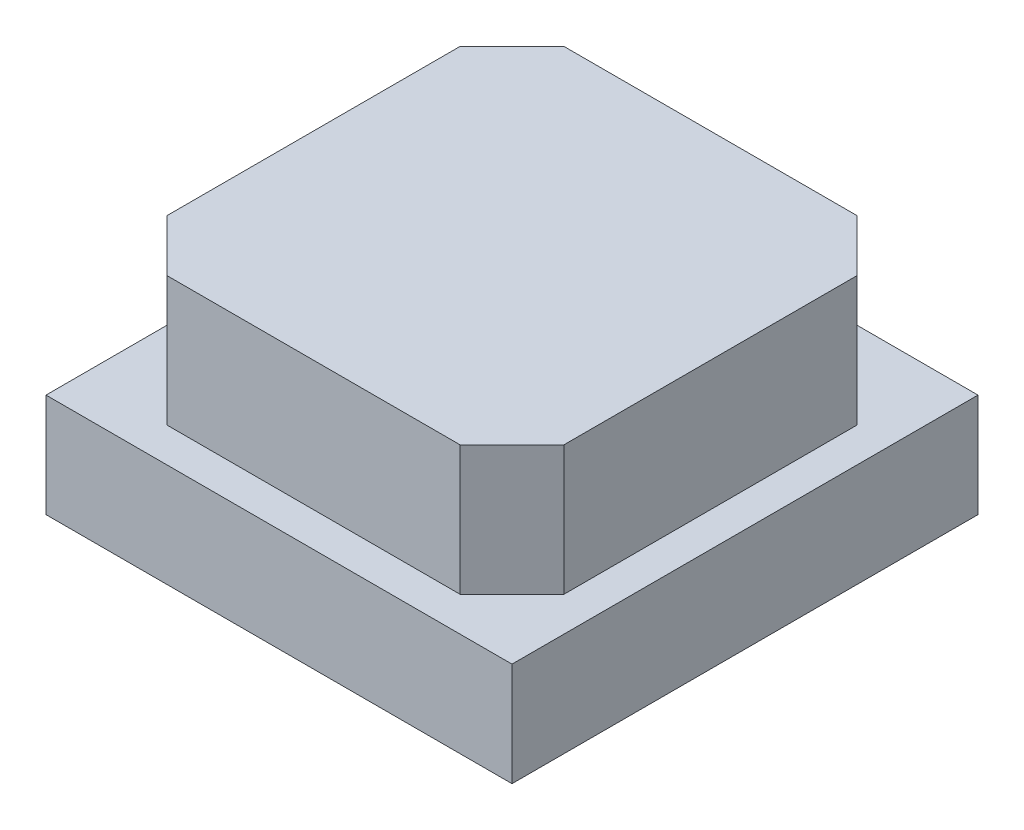
ISO-10303-21;
HEADER;
FILE_DESCRIPTION(('STEP AP214'),'2;1');
FILE_NAME('part.step','',(''),(''),'','','');
FILE_SCHEMA(('AUTOMOTIVE_DESIGN { 1 0 10303 214 1 1 1 1 }'));
ENDSEC;
DATA;
#1=APPLICATION_CONTEXT('core data for automotive mechanical design processes');
#2=APPLICATION_PROTOCOL_DEFINITION('international standard','automotive_design',2000,#1);
#3=PRODUCT_CONTEXT('',#1,'mechanical');
#4=PRODUCT('Part','Part','',(#3));
#5=PRODUCT_RELATED_PRODUCT_CATEGORY('part','',(#4));
#6=PRODUCT_DEFINITION_FORMATION('','',#4);
#7=PRODUCT_DEFINITION_CONTEXT('part definition',#1,'design');
#8=PRODUCT_DEFINITION('design','',#6,#7);
#9=PRODUCT_DEFINITION_SHAPE('','',#8);
#10=(LENGTH_UNIT() NAMED_UNIT(*) SI_UNIT(.MILLI.,.METRE.));
#11=(NAMED_UNIT(*) PLANE_ANGLE_UNIT() SI_UNIT($,.RADIAN.));
#12=(NAMED_UNIT(*) SI_UNIT($,.STERADIAN.) SOLID_ANGLE_UNIT());
#13=UNCERTAINTY_MEASURE_WITH_UNIT(LENGTH_MEASURE(1.E-05),#10,'distance_accuracy_value','');
#14=(GEOMETRIC_REPRESENTATION_CONTEXT(3) GLOBAL_UNCERTAINTY_ASSIGNED_CONTEXT((#13)) GLOBAL_UNIT_ASSIGNED_CONTEXT((#10,
#11,#12)) REPRESENTATION_CONTEXT('',''));
#15=CARTESIAN_POINT('',(0.,0.,0.));
#16=DIRECTION('',(0.,0.,1.));
#17=DIRECTION('',(1.,0.,0.));
#18=AXIS2_PLACEMENT_3D('',#15,#16,#17);
#19=CARTESIAN_POINT('',(0.,2.7,0.));
#20=DIRECTION('',(0.,1.,0.));
#21=DIRECTION('',(0.,0.,1.));
#22=AXIS2_PLACEMENT_3D('',#19,#20,#21);
#23=PLANE('',#22);
#24=DIRECTION('',(0.707106781186547,0.,0.707106781186547));
#25=VECTOR('',#24,1.);
#26=CARTESIAN_POINT('',(-2.3,2.7,1.7));
#27=LINE('',#26,#25);
#28=CARTESIAN_POINT('',(-2.3,2.7,1.7));
#29=VERTEX_POINT('',#28);
#30=CARTESIAN_POINT('',(-1.7,2.7,2.3));
#31=VERTEX_POINT('',#30);
#32=EDGE_CURVE('E20',#29,#31,#27,.T.);
#33=ORIENTED_EDGE('',*,*,#32,.T.);
#34=DIRECTION('',(1.,0.,0.));
#35=VECTOR('',#34,1.);
#36=CARTESIAN_POINT('',(-2.3,2.7,2.3));
#37=LINE('',#36,#35);
#38=CARTESIAN_POINT('',(1.7,2.7,2.3));
#39=VERTEX_POINT('',#38);
#40=EDGE_CURVE('E146',#39,#31,#37,.F.);
#41=ORIENTED_EDGE('',*,*,#40,.F.);
#42=DIRECTION('',(0.707106781186548,0.,-0.707106781186548));
#43=VECTOR('',#42,1.);
#44=CARTESIAN_POINT('',(2.,2.7,2.));
#45=LINE('',#44,#43);
#46=CARTESIAN_POINT('',(2.3,2.7,1.7));
#47=VERTEX_POINT('',#46);
#48=EDGE_CURVE('E138',#47,#39,#45,.F.);
#49=ORIENTED_EDGE('',*,*,#48,.F.);
#50=DIRECTION('',(0.,0.,-1.));
#51=VECTOR('',#50,1.);
#52=CARTESIAN_POINT('',(2.3,2.7,2.3));
#53=LINE('',#52,#51);
#54=CARTESIAN_POINT('',(2.3,2.7,-1.7));
#55=VERTEX_POINT('',#54);
#56=EDGE_CURVE('E136',#55,#47,#53,.F.);
#57=ORIENTED_EDGE('',*,*,#56,.F.);
#58=DIRECTION('',(-0.707106781186548,0.,-0.707106781186548));
#59=VECTOR('',#58,1.);
#60=CARTESIAN_POINT('',(2.,2.7,-2.));
#61=LINE('',#60,#59);
#62=CARTESIAN_POINT('',(1.7,2.7,-2.3));
#63=VERTEX_POINT('',#62);
#64=EDGE_CURVE('E128',#63,#55,#61,.F.);
#65=ORIENTED_EDGE('',*,*,#64,.F.);
#66=DIRECTION('',(-1.,0.,0.));
#67=VECTOR('',#66,1.);
#68=CARTESIAN_POINT('',(2.3,2.7,-2.3));
#69=LINE('',#68,#67);
#70=CARTESIAN_POINT('',(-1.7,2.7,-2.3));
#71=VERTEX_POINT('',#70);
#72=EDGE_CURVE('E123',#71,#63,#69,.F.);
#73=ORIENTED_EDGE('',*,*,#72,.F.);
#74=DIRECTION('',(-0.707106781186548,0.,0.707106781186548));
#75=VECTOR('',#74,1.);
#76=CARTESIAN_POINT('',(-2.,2.7,-2.));
#77=LINE('',#76,#75);
#78=CARTESIAN_POINT('',(-2.3,2.7,-1.7));
#79=VERTEX_POINT('',#78);
#80=EDGE_CURVE('E103',#79,#71,#77,.F.);
#81=ORIENTED_EDGE('',*,*,#80,.F.);
#82=DIRECTION('',(0.,0.,1.));
#83=VECTOR('',#82,1.);
#84=CARTESIAN_POINT('',(-2.3,2.7,-2.3));
#85=LINE('',#84,#83);
#86=EDGE_CURVE('E110',#29,#79,#85,.F.);
#87=ORIENTED_EDGE('',*,*,#86,.F.);
#88=EDGE_LOOP('',(#33,#41,#49,#57,#65,#73,#81,#87));
#89=FACE_BOUND('',#88,.T.);
#90=ADVANCED_FACE('F17',(#89),#23,.T.);
#91=CARTESIAN_POINT('',(-2.3,1.2,-2.3));
#92=DIRECTION('',(-1.,0.,0.));
#93=DIRECTION('',(0.,0.,1.));
#94=AXIS2_PLACEMENT_3D('',#91,#92,#93);
#95=PLANE('',#94);
#96=DIRECTION('',(0.,1.,0.));
#97=VECTOR('',#96,1.);
#98=CARTESIAN_POINT('',(-2.3,1.2,1.7));
#99=LINE('',#98,#97);
#100=CARTESIAN_POINT('',(-2.3,1.2,1.7));
#101=VERTEX_POINT('',#100);
#102=EDGE_CURVE('E115',#29,#101,#99,.F.);
#103=ORIENTED_EDGE('',*,*,#102,.F.);
#104=ORIENTED_EDGE('',*,*,#86,.T.);
#105=DIRECTION('',(0.,1.,0.));
#106=VECTOR('',#105,1.);
#107=CARTESIAN_POINT('',(-2.3,1.2,-1.7));
#108=LINE('',#107,#106);
#109=CARTESIAN_POINT('',(-2.3,1.2,-1.7));
#110=VERTEX_POINT('',#109);
#111=EDGE_CURVE('E113',#110,#79,#108,.T.);
#112=ORIENTED_EDGE('',*,*,#111,.F.);
#113=DIRECTION('',(0.,0.,1.));
#114=VECTOR('',#113,1.);
#115=CARTESIAN_POINT('',(-2.3,1.2,0.));
#116=LINE('',#115,#114);
#117=EDGE_CURVE('E153',#101,#110,#116,.F.);
#118=ORIENTED_EDGE('',*,*,#117,.F.);
#119=EDGE_LOOP('',(#103,#104,#112,#118));
#120=FACE_BOUND('',#119,.T.);
#121=ADVANCED_FACE('F111',(#120),#95,.T.);
#122=CARTESIAN_POINT('',(-2.,1.2,-2.));
#123=DIRECTION('',(-0.707106781186548,0.,-0.707106781186548));
#124=DIRECTION('',(-0.707106781186548,0.,0.707106781186548));
#125=AXIS2_PLACEMENT_3D('',#122,#123,#124);
#126=PLANE('',#125);
#127=DIRECTION('',(0.707106781186547,0.,-0.707106781186547));
#128=VECTOR('',#127,1.);
#129=CARTESIAN_POINT('',(-2.3,1.2,-1.7));
#130=LINE('',#129,#128);
#131=CARTESIAN_POINT('',(-1.7,1.2,-2.3));
#132=VERTEX_POINT('',#131);
#133=EDGE_CURVE('E118',#110,#132,#130,.T.);
#134=ORIENTED_EDGE('',*,*,#133,.F.);
#135=ORIENTED_EDGE('',*,*,#111,.T.);
#136=ORIENTED_EDGE('',*,*,#80,.T.);
#137=DIRECTION('',(0.,1.,0.));
#138=VECTOR('',#137,1.);
#139=CARTESIAN_POINT('',(-1.7,1.2,-2.3));
#140=LINE('',#139,#138);
#141=EDGE_CURVE('E119',#132,#71,#140,.T.);
#142=ORIENTED_EDGE('',*,*,#141,.F.);
#143=EDGE_LOOP('',(#134,#135,#136,#142));
#144=FACE_BOUND('',#143,.T.);
#145=ADVANCED_FACE('F117',(#144),#126,.T.);
#146=CARTESIAN_POINT('',(2.3,1.2,-2.3));
#147=DIRECTION('',(0.,0.,-1.));
#148=DIRECTION('',(-1.,0.,0.));
#149=AXIS2_PLACEMENT_3D('',#146,#147,#148);
#150=PLANE('',#149);
#151=ORIENTED_EDGE('',*,*,#141,.T.);
#152=ORIENTED_EDGE('',*,*,#72,.T.);
#153=DIRECTION('',(0.,1.,0.));
#154=VECTOR('',#153,1.);
#155=CARTESIAN_POINT('',(1.7,1.2,-2.3));
#156=LINE('',#155,#154);
#157=CARTESIAN_POINT('',(1.7,1.2,-2.3));
#158=VERTEX_POINT('',#157);
#159=EDGE_CURVE('E130',#158,#63,#156,.T.);
#160=ORIENTED_EDGE('',*,*,#159,.F.);
#161=DIRECTION('',(1.,0.,0.));
#162=VECTOR('',#161,1.);
#163=CARTESIAN_POINT('',(0.,1.2,-2.3));
#164=LINE('',#163,#162);
#165=EDGE_CURVE('E156',#132,#158,#164,.T.);
#166=ORIENTED_EDGE('',*,*,#165,.F.);
#167=EDGE_LOOP('',(#151,#152,#160,#166));
#168=FACE_BOUND('',#167,.T.);
#169=ADVANCED_FACE('F247',(#168),#150,.T.);
#170=CARTESIAN_POINT('',(2.,1.2,-2.));
#171=DIRECTION('',(0.707106781186548,0.,-0.707106781186548));
#172=DIRECTION('',(-0.707106781186548,0.,-0.707106781186548));
#173=AXIS2_PLACEMENT_3D('',#170,#171,#172);
#174=PLANE('',#173);
#175=DIRECTION('',(0.707106781186547,0.,0.707106781186547));
#176=VECTOR('',#175,1.);
#177=CARTESIAN_POINT('',(1.7,1.2,-2.3));
#178=LINE('',#177,#176);
#179=CARTESIAN_POINT('',(2.3,1.2,-1.7));
#180=VERTEX_POINT('',#179);
#181=EDGE_CURVE('E158',#158,#180,#178,.T.);
#182=ORIENTED_EDGE('',*,*,#181,.F.);
#183=ORIENTED_EDGE('',*,*,#159,.T.);
#184=ORIENTED_EDGE('',*,*,#64,.T.);
#185=DIRECTION('',(0.,1.,0.));
#186=VECTOR('',#185,1.);
#187=CARTESIAN_POINT('',(2.3,1.2,-1.7));
#188=LINE('',#187,#186);
#189=EDGE_CURVE('E133',#180,#55,#188,.T.);
#190=ORIENTED_EDGE('',*,*,#189,.F.);
#191=EDGE_LOOP('',(#182,#183,#184,#190));
#192=FACE_BOUND('',#191,.T.);
#193=ADVANCED_FACE('F243',(#192),#174,.T.);
#194=CARTESIAN_POINT('',(2.3,1.2,2.3));
#195=DIRECTION('',(1.,0.,0.));
#196=DIRECTION('',(0.,0.,-1.));
#197=AXIS2_PLACEMENT_3D('',#194,#195,#196);
#198=PLANE('',#197);
#199=ORIENTED_EDGE('',*,*,#189,.T.);
#200=ORIENTED_EDGE('',*,*,#56,.T.);
#201=DIRECTION('',(0.,1.,0.));
#202=VECTOR('',#201,1.);
#203=CARTESIAN_POINT('',(2.3,1.2,1.7));
#204=LINE('',#203,#202);
#205=CARTESIAN_POINT('',(2.3,1.2,1.7));
#206=VERTEX_POINT('',#205);
#207=EDGE_CURVE('E140',#206,#47,#204,.T.);
#208=ORIENTED_EDGE('',*,*,#207,.F.);
#209=DIRECTION('',(0.,0.,1.));
#210=VECTOR('',#209,1.);
#211=CARTESIAN_POINT('',(2.3,1.2,0.));
#212=LINE('',#211,#210);
#213=EDGE_CURVE('E160',#180,#206,#212,.T.);
#214=ORIENTED_EDGE('',*,*,#213,.F.);
#215=EDGE_LOOP('',(#199,#200,#208,#214));
#216=FACE_BOUND('',#215,.T.);
#217=ADVANCED_FACE('F239',(#216),#198,.T.);
#218=CARTESIAN_POINT('',(2.,1.2,2.));
#219=DIRECTION('',(0.707106781186548,0.,0.707106781186548));
#220=DIRECTION('',(0.707106781186548,0.,-0.707106781186548));
#221=AXIS2_PLACEMENT_3D('',#218,#219,#220);
#222=PLANE('',#221);
#223=DIRECTION('',(-0.707106781186547,0.,0.707106781186547));
#224=VECTOR('',#223,1.);
#225=CARTESIAN_POINT('',(2.3,1.2,1.7));
#226=LINE('',#225,#224);
#227=CARTESIAN_POINT('',(1.7,1.2,2.3));
#228=VERTEX_POINT('',#227);
#229=EDGE_CURVE('E162',#206,#228,#226,.T.);
#230=ORIENTED_EDGE('',*,*,#229,.F.);
#231=ORIENTED_EDGE('',*,*,#207,.T.);
#232=ORIENTED_EDGE('',*,*,#48,.T.);
#233=DIRECTION('',(0.,1.,0.));
#234=VECTOR('',#233,1.);
#235=CARTESIAN_POINT('',(1.7,1.2,2.3));
#236=LINE('',#235,#234);
#237=EDGE_CURVE('E143',#228,#39,#236,.T.);
#238=ORIENTED_EDGE('',*,*,#237,.F.);
#239=EDGE_LOOP('',(#230,#231,#232,#238));
#240=FACE_BOUND('',#239,.T.);
#241=ADVANCED_FACE('F235',(#240),#222,.T.);
#242=CARTESIAN_POINT('',(-2.3,1.2,2.3));
#243=DIRECTION('',(0.,0.,1.));
#244=DIRECTION('',(1.,0.,0.));
#245=AXIS2_PLACEMENT_3D('',#242,#243,#244);
#246=PLANE('',#245);
#247=DIRECTION('',(0.,1.,0.));
#248=VECTOR('',#247,1.);
#249=CARTESIAN_POINT('',(-1.7,1.2,2.3));
#250=LINE('',#249,#248);
#251=CARTESIAN_POINT('',(-1.7,1.2,2.3));
#252=VERTEX_POINT('',#251);
#253=EDGE_CURVE('E150',#252,#31,#250,.T.);
#254=ORIENTED_EDGE('',*,*,#253,.F.);
#255=DIRECTION('',(1.,0.,0.));
#256=VECTOR('',#255,1.);
#257=CARTESIAN_POINT('',(0.,1.2,2.3));
#258=LINE('',#257,#256);
#259=EDGE_CURVE('E164',#228,#252,#258,.F.);
#260=ORIENTED_EDGE('',*,*,#259,.F.);
#261=ORIENTED_EDGE('',*,*,#237,.T.);
#262=ORIENTED_EDGE('',*,*,#40,.T.);
#263=EDGE_LOOP('',(#254,#260,#261,#262));
#264=FACE_BOUND('',#263,.T.);
#265=ADVANCED_FACE('F231',(#264),#246,.T.);
#266=CARTESIAN_POINT('',(-2.,1.2,2.));
#267=DIRECTION('',(-0.707106781186548,0.,0.707106781186548));
#268=DIRECTION('',(0.707106781186548,0.,0.707106781186548));
#269=AXIS2_PLACEMENT_3D('',#266,#267,#268);
#270=PLANE('',#269);
#271=DIRECTION('',(-0.707106781186547,0.,-0.707106781186547));
#272=VECTOR('',#271,1.);
#273=CARTESIAN_POINT('',(-1.7,1.2,2.3));
#274=LINE('',#273,#272);
#275=EDGE_CURVE('E166',#252,#101,#274,.T.);
#276=ORIENTED_EDGE('',*,*,#275,.F.);
#277=ORIENTED_EDGE('',*,*,#253,.T.);
#278=ORIENTED_EDGE('',*,*,#32,.F.);
#279=ORIENTED_EDGE('',*,*,#102,.T.);
#280=EDGE_LOOP('',(#276,#277,#278,#279));
#281=FACE_BOUND('',#280,.T.);
#282=ADVANCED_FACE('F227',(#281),#270,.T.);
#283=CARTESIAN_POINT('',(0.,1.2,0.));
#284=DIRECTION('',(0.,1.,0.));
#285=DIRECTION('',(0.,0.,1.));
#286=AXIS2_PLACEMENT_3D('',#283,#284,#285);
#287=PLANE('',#286);
#288=ORIENTED_EDGE('',*,*,#259,.T.);
#289=ORIENTED_EDGE('',*,*,#275,.T.);
#290=ORIENTED_EDGE('',*,*,#117,.T.);
#291=ORIENTED_EDGE('',*,*,#133,.T.);
#292=ORIENTED_EDGE('',*,*,#165,.T.);
#293=ORIENTED_EDGE('',*,*,#181,.T.);
#294=ORIENTED_EDGE('',*,*,#213,.T.);
#295=ORIENTED_EDGE('',*,*,#229,.T.);
#296=EDGE_LOOP('',(#288,#289,#290,#291,#292,#293,#294,#295));
#297=FACE_BOUND('',#296,.T.);
#298=DIRECTION('',(-1.,0.,0.));
#299=VECTOR('',#298,1.);
#300=CARTESIAN_POINT('',(2.7,1.2,-2.7));
#301=LINE('',#300,#299);
#302=CARTESIAN_POINT('',(-2.7,1.2,-2.7));
#303=VERTEX_POINT('',#302);
#304=CARTESIAN_POINT('',(2.7,1.2,-2.7));
#305=VERTEX_POINT('',#304);
#306=EDGE_CURVE('E171',#303,#305,#301,.F.);
#307=ORIENTED_EDGE('',*,*,#306,.F.);
#308=DIRECTION('',(0.,0.,1.));
#309=VECTOR('',#308,1.);
#310=CARTESIAN_POINT('',(-2.7,1.2,-2.7));
#311=LINE('',#310,#309);
#312=CARTESIAN_POINT('',(-2.7,1.2,2.7));
#313=VERTEX_POINT('',#312);
#314=EDGE_CURVE('E175',#313,#303,#311,.F.);
#315=ORIENTED_EDGE('',*,*,#314,.F.);
#316=DIRECTION('',(1.,0.,0.));
#317=VECTOR('',#316,1.);
#318=CARTESIAN_POINT('',(-2.7,1.2,2.7));
#319=LINE('',#318,#317);
#320=CARTESIAN_POINT('',(2.7,1.2,2.7));
#321=VERTEX_POINT('',#320);
#322=EDGE_CURVE('E182',#321,#313,#319,.F.);
#323=ORIENTED_EDGE('',*,*,#322,.F.);
#324=DIRECTION('',(0.,0.,-1.));
#325=VECTOR('',#324,1.);
#326=CARTESIAN_POINT('',(2.7,1.2,2.7));
#327=LINE('',#326,#325);
#328=EDGE_CURVE('E169',#305,#321,#327,.F.);
#329=ORIENTED_EDGE('',*,*,#328,.F.);
#330=EDGE_LOOP('',(#307,#315,#323,#329));
#331=FACE_BOUND('',#330,.T.);
#332=ADVANCED_FACE('F224',(#297,#331),#287,.T.);
#333=CARTESIAN_POINT('',(2.7,0.,2.7));
#334=DIRECTION('',(1.,0.,0.));
#335=DIRECTION('',(0.,0.,-1.));
#336=AXIS2_PLACEMENT_3D('',#333,#334,#335);
#337=PLANE('',#336);
#338=ORIENTED_EDGE('',*,*,#328,.T.);
#339=DIRECTION('',(0.,1.,0.));
#340=VECTOR('',#339,1.);
#341=CARTESIAN_POINT('',(2.7,0.,2.7));
#342=LINE('',#341,#340);
#343=CARTESIAN_POINT('',(2.7,0.,2.7));
#344=VERTEX_POINT('',#343);
#345=EDGE_CURVE('E179',#344,#321,#342,.T.);
#346=ORIENTED_EDGE('',*,*,#345,.F.);
#347=DIRECTION('',(0.,0.,1.));
#348=VECTOR('',#347,1.);
#349=CARTESIAN_POINT('',(2.7,0.,0.));
#350=LINE('',#349,#348);
#351=CARTESIAN_POINT('',(2.7,0.,-2.7));
#352=VERTEX_POINT('',#351);
#353=EDGE_CURVE('E185',#344,#352,#350,.F.);
#354=ORIENTED_EDGE('',*,*,#353,.T.);
#355=DIRECTION('',(0.,1.,0.));
#356=VECTOR('',#355,1.);
#357=CARTESIAN_POINT('',(2.7,0.,-2.7));
#358=LINE('',#357,#356);
#359=EDGE_CURVE('E173',#305,#352,#358,.F.);
#360=ORIENTED_EDGE('',*,*,#359,.F.);
#361=EDGE_LOOP('',(#338,#346,#354,#360));
#362=FACE_BOUND('',#361,.T.);
#363=ADVANCED_FACE('F205',(#362),#337,.T.);
#364=CARTESIAN_POINT('',(2.7,0.,-2.7));
#365=DIRECTION('',(0.,0.,-1.));
#366=DIRECTION('',(-1.,0.,0.));
#367=AXIS2_PLACEMENT_3D('',#364,#365,#366);
#368=PLANE('',#367);
#369=ORIENTED_EDGE('',*,*,#306,.T.);
#370=ORIENTED_EDGE('',*,*,#359,.T.);
#371=DIRECTION('',(1.,0.,0.));
#372=VECTOR('',#371,1.);
#373=CARTESIAN_POINT('',(0.,0.,-2.7));
#374=LINE('',#373,#372);
#375=CARTESIAN_POINT('',(-2.7,0.,-2.7));
#376=VERTEX_POINT('',#375);
#377=EDGE_CURVE('E188',#352,#376,#374,.F.);
#378=ORIENTED_EDGE('',*,*,#377,.T.);
#379=DIRECTION('',(0.,1.,0.));
#380=VECTOR('',#379,1.);
#381=CARTESIAN_POINT('',(-2.7,0.,-2.7));
#382=LINE('',#381,#380);
#383=EDGE_CURVE('E177',#303,#376,#382,.F.);
#384=ORIENTED_EDGE('',*,*,#383,.F.);
#385=EDGE_LOOP('',(#369,#370,#378,#384));
#386=FACE_BOUND('',#385,.T.);
#387=ADVANCED_FACE('F200',(#386),#368,.T.);
#388=CARTESIAN_POINT('',(-2.7,0.,-2.7));
#389=DIRECTION('',(-1.,0.,0.));
#390=DIRECTION('',(0.,0.,1.));
#391=AXIS2_PLACEMENT_3D('',#388,#389,#390);
#392=PLANE('',#391);
#393=ORIENTED_EDGE('',*,*,#314,.T.);
#394=ORIENTED_EDGE('',*,*,#383,.T.);
#395=DIRECTION('',(0.,0.,1.));
#396=VECTOR('',#395,1.);
#397=CARTESIAN_POINT('',(-2.7,0.,0.));
#398=LINE('',#397,#396);
#399=CARTESIAN_POINT('',(-2.7,0.,2.7));
#400=VERTEX_POINT('',#399);
#401=EDGE_CURVE('E26',#376,#400,#398,.T.);
#402=ORIENTED_EDGE('',*,*,#401,.T.);
#403=DIRECTION('',(0.,1.,0.));
#404=VECTOR('',#403,1.);
#405=CARTESIAN_POINT('',(-2.7,0.,2.7));
#406=LINE('',#405,#404);
#407=EDGE_CURVE('E34',#313,#400,#406,.F.);
#408=ORIENTED_EDGE('',*,*,#407,.F.);
#409=EDGE_LOOP('',(#393,#394,#402,#408));
#410=FACE_BOUND('',#409,.T.);
#411=ADVANCED_FACE('F194',(#410),#392,.T.);
#412=CARTESIAN_POINT('',(-2.7,0.,2.7));
#413=DIRECTION('',(0.,0.,1.));
#414=DIRECTION('',(1.,0.,0.));
#415=AXIS2_PLACEMENT_3D('',#412,#413,#414);
#416=PLANE('',#415);
#417=ORIENTED_EDGE('',*,*,#322,.T.);
#418=ORIENTED_EDGE('',*,*,#407,.T.);
#419=DIRECTION('',(1.,0.,0.));
#420=VECTOR('',#419,1.);
#421=CARTESIAN_POINT('',(0.,0.,2.7));
#422=LINE('',#421,#420);
#423=EDGE_CURVE('E11',#400,#344,#422,.T.);
#424=ORIENTED_EDGE('',*,*,#423,.T.);
#425=ORIENTED_EDGE('',*,*,#345,.T.);
#426=EDGE_LOOP('',(#417,#418,#424,#425));
#427=FACE_BOUND('',#426,.T.);
#428=ADVANCED_FACE('F208',(#427),#416,.T.);
#429=CARTESIAN_POINT('',(0.,0.,0.));
#430=DIRECTION('',(0.,1.,0.));
#431=DIRECTION('',(0.,0.,1.));
#432=AXIS2_PLACEMENT_3D('',#429,#430,#431);
#433=PLANE('',#432);
#434=ORIENTED_EDGE('',*,*,#401,.F.);
#435=ORIENTED_EDGE('',*,*,#377,.F.);
#436=ORIENTED_EDGE('',*,*,#353,.F.);
#437=ORIENTED_EDGE('',*,*,#423,.F.);
#438=EDGE_LOOP('',(#434,#435,#436,#437));
#439=FACE_BOUND('',#438,.T.);
#440=ADVANCED_FACE('F198',(#439),#433,.F.);
#441=CLOSED_SHELL('',(#90,#121,#145,#169,#193,#217,#241,#265,#282,#332,#363,#387,#411,#428,#440));
#442=MANIFOLD_SOLID_BREP('B1',#441);
#443=ADVANCED_BREP_SHAPE_REPRESENTATION('',(#18,#442),#14);
#444=SHAPE_DEFINITION_REPRESENTATION(#9,#443);
ENDSEC;
END-ISO-10303-21;
